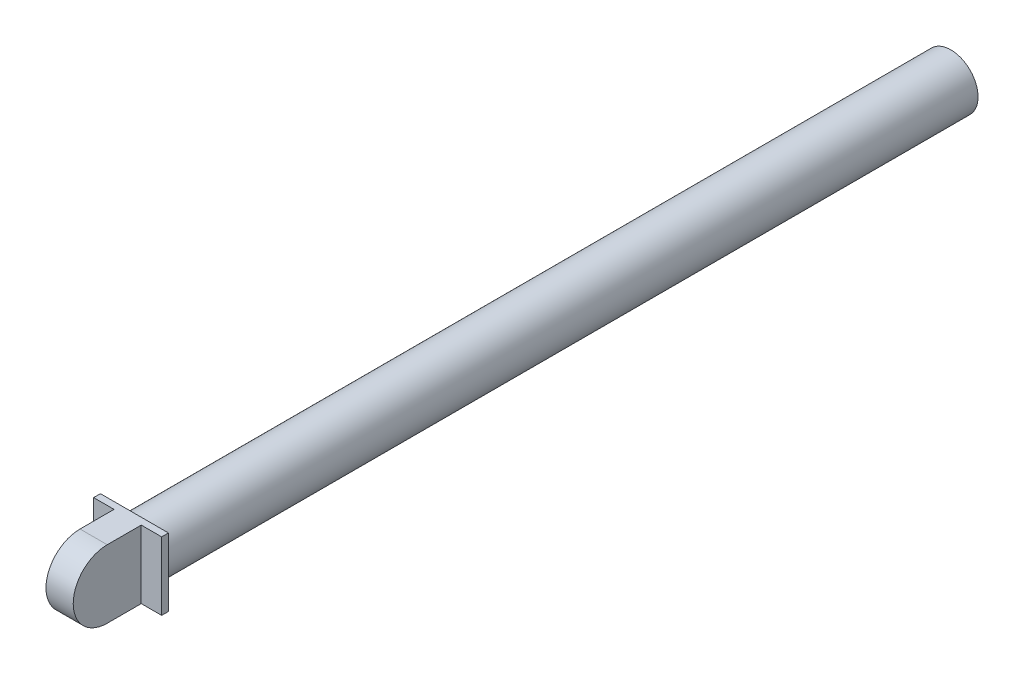
ISO-10303-21;
HEADER;
FILE_DESCRIPTION(('STEP AP214'),'2;1');
FILE_NAME('part.step','',(''),(''),'','','');
FILE_SCHEMA(('AUTOMOTIVE_DESIGN { 1 0 10303 214 1 1 1 1 }'));
ENDSEC;
DATA;
#1=APPLICATION_CONTEXT('core data for automotive mechanical design processes');
#2=APPLICATION_PROTOCOL_DEFINITION('international standard','automotive_design',2000,#1);
#3=PRODUCT_CONTEXT('',#1,'mechanical');
#4=PRODUCT('Part','Part','',(#3));
#5=PRODUCT_RELATED_PRODUCT_CATEGORY('part','',(#4));
#6=PRODUCT_DEFINITION_FORMATION('','',#4);
#7=PRODUCT_DEFINITION_CONTEXT('part definition',#1,'design');
#8=PRODUCT_DEFINITION('design','',#6,#7);
#9=PRODUCT_DEFINITION_SHAPE('','',#8);
#10=(LENGTH_UNIT() NAMED_UNIT(*) SI_UNIT(.MILLI.,.METRE.));
#11=(NAMED_UNIT(*) PLANE_ANGLE_UNIT() SI_UNIT($,.RADIAN.));
#12=(NAMED_UNIT(*) SI_UNIT($,.STERADIAN.) SOLID_ANGLE_UNIT());
#13=UNCERTAINTY_MEASURE_WITH_UNIT(LENGTH_MEASURE(1.E-05),#10,'distance_accuracy_value','');
#14=(GEOMETRIC_REPRESENTATION_CONTEXT(3) GLOBAL_UNCERTAINTY_ASSIGNED_CONTEXT((#13)) GLOBAL_UNIT_ASSIGNED_CONTEXT((#10,
#11,#12)) REPRESENTATION_CONTEXT('',''));
#15=CARTESIAN_POINT('',(0.,0.,0.));
#16=DIRECTION('',(0.,0.,1.));
#17=DIRECTION('',(1.,0.,0.));
#18=AXIS2_PLACEMENT_3D('',#15,#16,#17);
#19=CARTESIAN_POINT('',(-5.,5.,11.));
#20=DIRECTION('',(0.,-1.,0.));
#21=DIRECTION('',(1.,0.,0.));
#22=AXIS2_PLACEMENT_3D('',#19,#20,#21);
#23=PLANE('',#22);
#24=DIRECTION('',(1.,0.,0.));
#25=VECTOR('',#24,1.);
#26=CARTESIAN_POINT('',(-78.,5.00000000000001,6.));
#27=LINE('',#26,#25);
#28=CARTESIAN_POINT('',(-2.,5.,6.));
#29=VERTEX_POINT('',#28);
#30=CARTESIAN_POINT('',(2.,5.,6.));
#31=VERTEX_POINT('',#30);
#32=EDGE_CURVE('E49',#29,#31,#27,.T.);
#33=ORIENTED_EDGE('',*,*,#32,.T.);
#34=DIRECTION('',(0.,0.,1.));
#35=VECTOR('',#34,1.);
#36=CARTESIAN_POINT('',(2.,5.,11.));
#37=LINE('',#36,#35);
#38=CARTESIAN_POINT('',(2.,5.,0.999999999999999));
#39=VERTEX_POINT('',#38);
#40=EDGE_CURVE('E110',#39,#31,#37,.T.);
#41=ORIENTED_EDGE('',*,*,#40,.F.);
#42=DIRECTION('',(-1.,0.,0.));
#43=VECTOR('',#42,1.);
#44=CARTESIAN_POINT('',(2.,5.,0.999999999999999));
#45=LINE('',#44,#43);
#46=CARTESIAN_POINT('',(5.,5.,0.999999999999999));
#47=VERTEX_POINT('',#46);
#48=EDGE_CURVE('E118',#47,#39,#45,.T.);
#49=ORIENTED_EDGE('',*,*,#48,.F.);
#50=DIRECTION('',(0.,0.,-1.));
#51=VECTOR('',#50,1.);
#52=CARTESIAN_POINT('',(5.,5.,11.));
#53=LINE('',#52,#51);
#54=CARTESIAN_POINT('',(5.,5.,0.));
#55=VERTEX_POINT('',#54);
#56=EDGE_CURVE('E149',#47,#55,#53,.T.);
#57=ORIENTED_EDGE('',*,*,#56,.T.);
#58=DIRECTION('',(-1.,0.,0.));
#59=VECTOR('',#58,1.);
#60=CARTESIAN_POINT('',(-5.,5.,0.));
#61=LINE('',#60,#59);
#62=CARTESIAN_POINT('',(-5.,5.,0.));
#63=VERTEX_POINT('',#62);
#64=EDGE_CURVE('E146',#55,#63,#61,.T.);
#65=ORIENTED_EDGE('',*,*,#64,.T.);
#66=DIRECTION('',(0.,0.,-1.));
#67=VECTOR('',#66,1.);
#68=CARTESIAN_POINT('',(-5.,5.,11.));
#69=LINE('',#68,#67);
#70=CARTESIAN_POINT('',(-5.,5.,0.999999999999999));
#71=VERTEX_POINT('',#70);
#72=EDGE_CURVE('E56',#71,#63,#69,.T.);
#73=ORIENTED_EDGE('',*,*,#72,.F.);
#74=DIRECTION('',(-1.,0.,0.));
#75=VECTOR('',#74,1.);
#76=CARTESIAN_POINT('',(-5.,5.,0.999999999999999));
#77=LINE('',#76,#75);
#78=CARTESIAN_POINT('',(-2.,5.,0.999999999999999));
#79=VERTEX_POINT('',#78);
#80=EDGE_CURVE('E163',#79,#71,#77,.T.);
#81=ORIENTED_EDGE('',*,*,#80,.F.);
#82=DIRECTION('',(0.,0.,-1.));
#83=VECTOR('',#82,1.);
#84=CARTESIAN_POINT('',(-2.,5.,11.));
#85=LINE('',#84,#83);
#86=EDGE_CURVE('E112',#29,#79,#85,.T.);
#87=ORIENTED_EDGE('',*,*,#86,.F.);
#88=EDGE_LOOP('',(#33,#41,#49,#57,#65,#73,#81,#87));
#89=FACE_BOUND('',#88,.T.);
#90=ADVANCED_FACE('F34',(#89),#23,.F.);
#91=CARTESIAN_POINT('',(-5.,5.,11.));
#92=DIRECTION('',(1.,0.,0.));
#93=DIRECTION('',(0.,1.,0.));
#94=AXIS2_PLACEMENT_3D('',#91,#92,#93);
#95=PLANE('',#94);
#96=DIRECTION('',(0.,0.,-1.));
#97=VECTOR('',#96,1.);
#98=CARTESIAN_POINT('',(-5.,-5.,11.));
#99=LINE('',#98,#97);
#100=CARTESIAN_POINT('',(-5.,-5.,0.999999999999999));
#101=VERTEX_POINT('',#100);
#102=CARTESIAN_POINT('',(-5.,-5.,0.));
#103=VERTEX_POINT('',#102);
#104=EDGE_CURVE('E152',#101,#103,#99,.T.);
#105=ORIENTED_EDGE('',*,*,#104,.F.);
#106=DIRECTION('',(0.,1.,0.));
#107=VECTOR('',#106,1.);
#108=CARTESIAN_POINT('',(-5.,-6.,0.999999999999999));
#109=LINE('',#108,#107);
#110=EDGE_CURVE('E130',#101,#71,#109,.T.);
#111=ORIENTED_EDGE('',*,*,#110,.T.);
#112=ORIENTED_EDGE('',*,*,#72,.T.);
#113=DIRECTION('',(0.,-1.,0.));
#114=VECTOR('',#113,1.);
#115=CARTESIAN_POINT('',(-5.,5.,0.));
#116=LINE('',#115,#114);
#117=EDGE_CURVE('E138',#63,#103,#116,.T.);
#118=ORIENTED_EDGE('',*,*,#117,.T.);
#119=EDGE_LOOP('',(#105,#111,#112,#118));
#120=FACE_BOUND('',#119,.T.);
#121=ADVANCED_FACE('F36',(#120),#95,.F.);
#122=CARTESIAN_POINT('',(-5.,-5.,11.));
#123=DIRECTION('',(0.,1.,0.));
#124=DIRECTION('',(-1.,0.,0.));
#125=AXIS2_PLACEMENT_3D('',#122,#123,#124);
#126=PLANE('',#125);
#127=DIRECTION('',(0.,0.,1.));
#128=VECTOR('',#127,1.);
#129=CARTESIAN_POINT('',(2.,-5.,11.));
#130=LINE('',#129,#128);
#131=CARTESIAN_POINT('',(2.,-5.,0.999999999999999));
#132=VERTEX_POINT('',#131);
#133=CARTESIAN_POINT('',(2.,-5.,6.));
#134=VERTEX_POINT('',#133);
#135=EDGE_CURVE('E127',#132,#134,#130,.T.);
#136=ORIENTED_EDGE('',*,*,#135,.T.);
#137=DIRECTION('',(1.,0.,0.));
#138=VECTOR('',#137,1.);
#139=CARTESIAN_POINT('',(-78.,-4.99999999999999,6.));
#140=LINE('',#139,#138);
#141=CARTESIAN_POINT('',(-2.,-5.,6.));
#142=VERTEX_POINT('',#141);
#143=EDGE_CURVE('E101',#142,#134,#140,.T.);
#144=ORIENTED_EDGE('',*,*,#143,.F.);
#145=DIRECTION('',(0.,0.,-1.));
#146=VECTOR('',#145,1.);
#147=CARTESIAN_POINT('',(-2.,-5.,11.));
#148=LINE('',#147,#146);
#149=CARTESIAN_POINT('',(-2.,-5.,0.999999999999999));
#150=VERTEX_POINT('',#149);
#151=EDGE_CURVE('E129',#142,#150,#148,.T.);
#152=ORIENTED_EDGE('',*,*,#151,.T.);
#153=DIRECTION('',(-1.,0.,0.));
#154=VECTOR('',#153,1.);
#155=CARTESIAN_POINT('',(-5.,-5.,0.999999999999999));
#156=LINE('',#155,#154);
#157=EDGE_CURVE('E135',#150,#101,#156,.T.);
#158=ORIENTED_EDGE('',*,*,#157,.T.);
#159=ORIENTED_EDGE('',*,*,#104,.T.);
#160=DIRECTION('',(1.,0.,0.));
#161=VECTOR('',#160,1.);
#162=CARTESIAN_POINT('',(-5.,-5.,0.));
#163=LINE('',#162,#161);
#164=CARTESIAN_POINT('',(5.,-5.,0.));
#165=VERTEX_POINT('',#164);
#166=EDGE_CURVE('E140',#103,#165,#163,.T.);
#167=ORIENTED_EDGE('',*,*,#166,.T.);
#168=DIRECTION('',(0.,0.,-1.));
#169=VECTOR('',#168,1.);
#170=CARTESIAN_POINT('',(5.,-5.,11.));
#171=LINE('',#170,#169);
#172=CARTESIAN_POINT('',(5.,-5.,0.999999999999999));
#173=VERTEX_POINT('',#172);
#174=EDGE_CURVE('E151',#173,#165,#171,.T.);
#175=ORIENTED_EDGE('',*,*,#174,.F.);
#176=DIRECTION('',(-1.,0.,0.));
#177=VECTOR('',#176,1.);
#178=CARTESIAN_POINT('',(-5.,-5.,0.999999999999999));
#179=LINE('',#178,#177);
#180=EDGE_CURVE('E132',#173,#132,#179,.T.);
#181=ORIENTED_EDGE('',*,*,#180,.T.);
#182=EDGE_LOOP('',(#136,#144,#152,#158,#159,#167,#175,#181));
#183=FACE_BOUND('',#182,.T.);
#184=ADVANCED_FACE('F179',(#183),#126,.F.);
#185=CARTESIAN_POINT('',(5.,5.,11.));
#186=DIRECTION('',(-1.,0.,0.));
#187=DIRECTION('',(0.,-1.,0.));
#188=AXIS2_PLACEMENT_3D('',#185,#186,#187);
#189=PLANE('',#188);
#190=ORIENTED_EDGE('',*,*,#56,.F.);
#191=DIRECTION('',(0.,1.,0.));
#192=VECTOR('',#191,1.);
#193=CARTESIAN_POINT('',(5.,-6.,0.999999999999999));
#194=LINE('',#193,#192);
#195=EDGE_CURVE('E120',#173,#47,#194,.T.);
#196=ORIENTED_EDGE('',*,*,#195,.F.);
#197=ORIENTED_EDGE('',*,*,#174,.T.);
#198=DIRECTION('',(0.,1.,0.));
#199=VECTOR('',#198,1.);
#200=CARTESIAN_POINT('',(5.,5.,0.));
#201=LINE('',#200,#199);
#202=EDGE_CURVE('E143',#165,#55,#201,.T.);
#203=ORIENTED_EDGE('',*,*,#202,.T.);
#204=EDGE_LOOP('',(#190,#196,#197,#203));
#205=FACE_BOUND('',#204,.T.);
#206=ADVANCED_FACE('F201',(#205),#189,.F.);
#207=CARTESIAN_POINT('',(0.,0.,0.));
#208=DIRECTION('',(0.,0.,1.));
#209=DIRECTION('',(1.,0.,0.));
#210=AXIS2_PLACEMENT_3D('',#207,#208,#209);
#211=PLANE('',#210);
#212=CARTESIAN_POINT('',(0.,0.,0.));
#213=DIRECTION('',(0.,0.,-1.));
#214=DIRECTION('',(-1.,0.,0.));
#215=AXIS2_PLACEMENT_3D('',#212,#213,#214);
#216=CIRCLE('',#215,4.);
#217=CARTESIAN_POINT('',(-4.,0.,0.));
#218=VERTEX_POINT('',#217);
#219=EDGE_CURVE('E42',#218,#218,#216,.T.);
#220=ORIENTED_EDGE('',*,*,#219,.F.);
#221=EDGE_LOOP('',(#220));
#222=FACE_BOUND('',#221,.T.);
#223=ORIENTED_EDGE('',*,*,#117,.F.);
#224=ORIENTED_EDGE('',*,*,#64,.F.);
#225=ORIENTED_EDGE('',*,*,#202,.F.);
#226=ORIENTED_EDGE('',*,*,#166,.F.);
#227=EDGE_LOOP('',(#223,#224,#225,#226));
#228=FACE_BOUND('',#227,.T.);
#229=ADVANCED_FACE('F178',(#222,#228),#211,.F.);
#230=CARTESIAN_POINT('',(2.,-6.,0.999999999999999));
#231=DIRECTION('',(0.,0.,-1.));
#232=DIRECTION('',(-1.,0.,0.));
#233=AXIS2_PLACEMENT_3D('',#230,#231,#232);
#234=PLANE('',#233);
#235=ORIENTED_EDGE('',*,*,#195,.T.);
#236=ORIENTED_EDGE('',*,*,#48,.T.);
#237=DIRECTION('',(0.,1.,0.));
#238=VECTOR('',#237,1.);
#239=CARTESIAN_POINT('',(2.,-6.,0.999999999999999));
#240=LINE('',#239,#238);
#241=EDGE_CURVE('E116',#132,#39,#240,.T.);
#242=ORIENTED_EDGE('',*,*,#241,.F.);
#243=ORIENTED_EDGE('',*,*,#180,.F.);
#244=EDGE_LOOP('',(#235,#236,#242,#243));
#245=FACE_BOUND('',#244,.T.);
#246=ADVANCED_FACE('F221',(#245),#234,.F.);
#247=CARTESIAN_POINT('',(2.,-6.,11.));
#248=DIRECTION('',(-1.,0.,0.));
#249=DIRECTION('',(0.,-1.,0.));
#250=AXIS2_PLACEMENT_3D('',#247,#248,#249);
#251=PLANE('',#250);
#252=ORIENTED_EDGE('',*,*,#40,.T.);
#253=CARTESIAN_POINT('',(2.,0.,6.));
#254=DIRECTION('',(-1.,0.,0.));
#255=DIRECTION('',(0.,1.,0.));
#256=AXIS2_PLACEMENT_3D('',#253,#254,#255);
#257=CIRCLE('',#256,5.);
#258=EDGE_CURVE('E98',#134,#31,#257,.T.);
#259=ORIENTED_EDGE('',*,*,#258,.F.);
#260=ORIENTED_EDGE('',*,*,#135,.F.);
#261=ORIENTED_EDGE('',*,*,#241,.T.);
#262=EDGE_LOOP('',(#252,#259,#260,#261));
#263=FACE_BOUND('',#262,.T.);
#264=ADVANCED_FACE('F114',(#263),#251,.F.);
#265=CARTESIAN_POINT('',(-5.,-6.,0.999999999999999));
#266=DIRECTION('',(0.,0.,-1.));
#267=DIRECTION('',(-1.,0.,0.));
#268=AXIS2_PLACEMENT_3D('',#265,#266,#267);
#269=PLANE('',#268);
#270=DIRECTION('',(0.,1.,0.));
#271=VECTOR('',#270,1.);
#272=CARTESIAN_POINT('',(-2.,-6.,0.999999999999999));
#273=LINE('',#272,#271);
#274=EDGE_CURVE('E165',#150,#79,#273,.T.);
#275=ORIENTED_EDGE('',*,*,#274,.T.);
#276=ORIENTED_EDGE('',*,*,#80,.T.);
#277=ORIENTED_EDGE('',*,*,#110,.F.);
#278=ORIENTED_EDGE('',*,*,#157,.F.);
#279=EDGE_LOOP('',(#275,#276,#277,#278));
#280=FACE_BOUND('',#279,.T.);
#281=ADVANCED_FACE('F170',(#280),#269,.F.);
#282=CARTESIAN_POINT('',(-2.,-6.,11.));
#283=DIRECTION('',(1.,0.,0.));
#284=DIRECTION('',(0.,1.,0.));
#285=AXIS2_PLACEMENT_3D('',#282,#283,#284);
#286=PLANE('',#285);
#287=ORIENTED_EDGE('',*,*,#151,.F.);
#288=CARTESIAN_POINT('',(-2.,0.,6.));
#289=DIRECTION('',(1.,0.,0.));
#290=DIRECTION('',(0.,1.,0.));
#291=AXIS2_PLACEMENT_3D('',#288,#289,#290);
#292=CIRCLE('',#291,5.);
#293=EDGE_CURVE('E11',#142,#29,#292,.F.);
#294=ORIENTED_EDGE('',*,*,#293,.T.);
#295=ORIENTED_EDGE('',*,*,#86,.T.);
#296=ORIENTED_EDGE('',*,*,#274,.F.);
#297=EDGE_LOOP('',(#287,#294,#295,#296));
#298=FACE_BOUND('',#297,.T.);
#299=ADVANCED_FACE('F180',(#298),#286,.F.);
#300=CARTESIAN_POINT('',(0.,0.,-120.));
#301=DIRECTION('',(0.,0.,1.));
#302=DIRECTION('',(1.,0.,0.));
#303=AXIS2_PLACEMENT_3D('',#300,#301,#302);
#304=CYLINDRICAL_SURFACE('',#303,4.);
#305=CARTESIAN_POINT('',(0.,0.,-120.));
#306=DIRECTION('',(0.,0.,-1.));
#307=DIRECTION('',(-1.,0.,0.));
#308=AXIS2_PLACEMENT_3D('',#305,#306,#307);
#309=CIRCLE('',#308,4.);
#310=CARTESIAN_POINT('',(-4.,0.,-120.));
#311=VERTEX_POINT('',#310);
#312=EDGE_CURVE('E122',#311,#311,#309,.T.);
#313=ORIENTED_EDGE('',*,*,#312,.F.);
#314=EDGE_LOOP('',(#313));
#315=FACE_BOUND('',#314,.T.);
#316=ORIENTED_EDGE('',*,*,#219,.T.);
#317=EDGE_LOOP('',(#316));
#318=FACE_BOUND('',#317,.T.);
#319=ADVANCED_FACE('F182',(#315,#318),#304,.T.);
#320=CARTESIAN_POINT('',(0.,0.,-120.));
#321=DIRECTION('',(0.,0.,-1.));
#322=DIRECTION('',(-1.,0.,0.));
#323=AXIS2_PLACEMENT_3D('',#320,#321,#322);
#324=PLANE('',#323);
#325=ORIENTED_EDGE('',*,*,#312,.T.);
#326=EDGE_LOOP('',(#325));
#327=FACE_BOUND('',#326,.T.);
#328=ADVANCED_FACE('F188',(#327),#324,.T.);
#329=CARTESIAN_POINT('',(-78.,0.,6.));
#330=DIRECTION('',(1.,0.,0.));
#331=DIRECTION('',(0.,1.,0.));
#332=AXIS2_PLACEMENT_3D('',#329,#330,#331);
#333=CYLINDRICAL_SURFACE('',#332,5.);
#334=ORIENTED_EDGE('',*,*,#258,.T.);
#335=ORIENTED_EDGE('',*,*,#32,.F.);
#336=ORIENTED_EDGE('',*,*,#293,.F.);
#337=ORIENTED_EDGE('',*,*,#143,.T.);
#338=EDGE_LOOP('',(#334,#335,#336,#337));
#339=FACE_BOUND('',#338,.T.);
#340=ADVANCED_FACE('F99',(#339),#333,.T.);
#341=CLOSED_SHELL('',(#90,#121,#184,#206,#229,#246,#264,#281,#299,#319,#328,#340));
#342=MANIFOLD_SOLID_BREP('B2',#341);
#343=ADVANCED_BREP_SHAPE_REPRESENTATION('',(#18,#342),#14);
#344=SHAPE_DEFINITION_REPRESENTATION(#9,#343);
ENDSEC;
END-ISO-10303-21;
